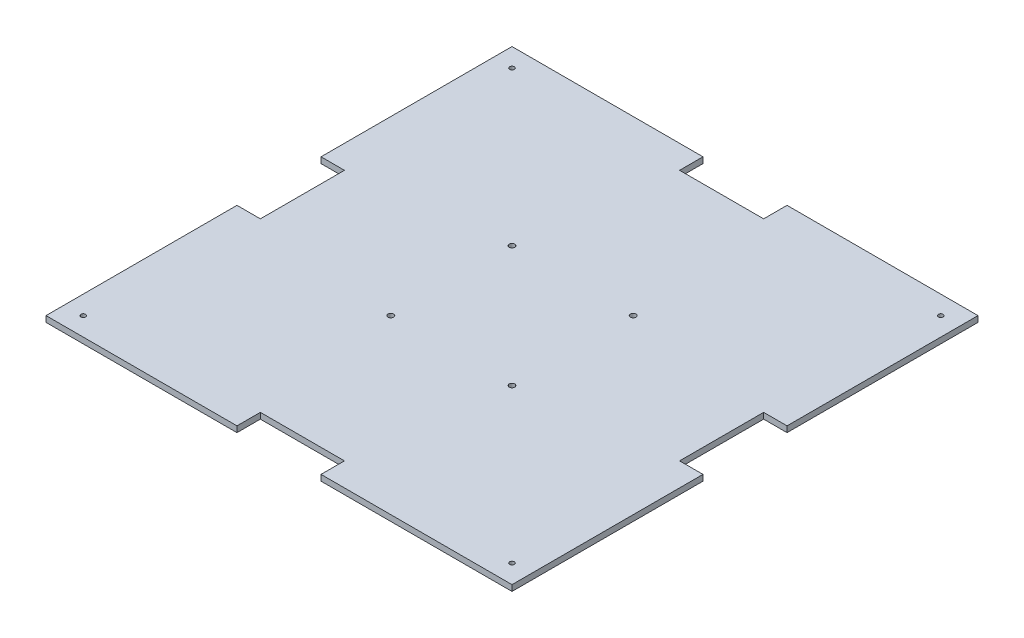
ISO-10303-21;
HEADER;
FILE_DESCRIPTION(('STEP AP214'),'2;1');
FILE_NAME('part.step','',(''),(''),'','','');
FILE_SCHEMA(('AUTOMOTIVE_DESIGN { 1 0 10303 214 1 1 1 1 }'));
ENDSEC;
DATA;
#1=APPLICATION_CONTEXT('core data for automotive mechanical design processes');
#2=APPLICATION_PROTOCOL_DEFINITION('international standard','automotive_design',2000,#1);
#3=PRODUCT_CONTEXT('',#1,'mechanical');
#4=PRODUCT('Part','Part','',(#3));
#5=PRODUCT_RELATED_PRODUCT_CATEGORY('part','',(#4));
#6=PRODUCT_DEFINITION_FORMATION('','',#4);
#7=PRODUCT_DEFINITION_CONTEXT('part definition',#1,'design');
#8=PRODUCT_DEFINITION('design','',#6,#7);
#9=PRODUCT_DEFINITION_SHAPE('','',#8);
#10=(LENGTH_UNIT() NAMED_UNIT(*) SI_UNIT(.MILLI.,.METRE.));
#11=(NAMED_UNIT(*) PLANE_ANGLE_UNIT() SI_UNIT($,.RADIAN.));
#12=(NAMED_UNIT(*) SI_UNIT($,.STERADIAN.) SOLID_ANGLE_UNIT());
#13=UNCERTAINTY_MEASURE_WITH_UNIT(LENGTH_MEASURE(1.E-05),#10,'distance_accuracy_value','');
#14=(GEOMETRIC_REPRESENTATION_CONTEXT(3) GLOBAL_UNCERTAINTY_ASSIGNED_CONTEXT((#13)) GLOBAL_UNIT_ASSIGNED_CONTEXT((#10,
#11,#12)) REPRESENTATION_CONTEXT('',''));
#15=CARTESIAN_POINT('',(0.,0.,0.));
#16=DIRECTION('',(0.,0.,1.));
#17=DIRECTION('',(1.,0.,0.));
#18=AXIS2_PLACEMENT_3D('',#15,#16,#17);
#19=CARTESIAN_POINT('',(234.900589833558,131.687026836977,334.189670911384));
#20=DIRECTION('',(-1.,0.,0.));
#21=DIRECTION('',(0.,0.,1.));
#22=AXIS2_PLACEMENT_3D('',#19,#20,#21);
#23=PLANE('',#22);
#24=DIRECTION('',(0.,0.,-1.));
#25=VECTOR('',#24,1.);
#26=CARTESIAN_POINT('',(234.900589833558,131.687026836977,334.189670911384));
#27=LINE('',#26,#25);
#28=CARTESIAN_POINT('',(234.900589833558,131.687026836977,186.639670911382));
#29=VERTEX_POINT('',#28);
#30=CARTESIAN_POINT('',(234.900589833558,131.687026836977,84.1896709113836));
#31=VERTEX_POINT('',#30);
#32=EDGE_CURVE('E237',#29,#31,#27,.T.);
#33=ORIENTED_EDGE('',*,*,#32,.F.);
#34=DIRECTION('',(0.,-1.,0.));
#35=VECTOR('',#34,1.);
#36=CARTESIAN_POINT('',(234.900589833558,131.687026836977,186.639670911382));
#37=LINE('',#36,#35);
#38=CARTESIAN_POINT('',(234.900589833558,128.512026836977,186.639670911382));
#39=VERTEX_POINT('',#38);
#40=EDGE_CURVE('E225',#29,#39,#37,.T.);
#41=ORIENTED_EDGE('',*,*,#40,.T.);
#42=DIRECTION('',(0.,0.,-1.));
#43=VECTOR('',#42,1.);
#44=CARTESIAN_POINT('',(234.900589833558,128.512026836977,334.189670911384));
#45=LINE('',#44,#43);
#46=CARTESIAN_POINT('',(234.900589833558,128.512026836977,84.1896709113836));
#47=VERTEX_POINT('',#46);
#48=EDGE_CURVE('E232',#39,#47,#45,.T.);
#49=ORIENTED_EDGE('',*,*,#48,.T.);
#50=DIRECTION('',(0.,-1.,0.));
#51=VECTOR('',#50,1.);
#52=CARTESIAN_POINT('',(234.900589833558,131.687026836977,84.1896709113836));
#53=LINE('',#52,#51);
#54=EDGE_CURVE('E272',#31,#47,#53,.T.);
#55=ORIENTED_EDGE('',*,*,#54,.F.);
#56=EDGE_LOOP('',(#33,#41,#49,#55));
#57=FACE_BOUND('',#56,.T.);
#58=ADVANCED_FACE('F16',(#57),#23,.F.);
#59=CARTESIAN_POINT('',(-15.0994101664421,131.687026836977,84.1896709113836));
#60=DIRECTION('',(0.,0.,1.));
#61=DIRECTION('',(1.,0.,0.));
#62=AXIS2_PLACEMENT_3D('',#59,#60,#61);
#63=PLANE('',#62);
#64=DIRECTION('',(-1.,0.,0.));
#65=VECTOR('',#64,1.);
#66=CARTESIAN_POINT('',(-15.0994101664421,128.512026836977,84.1896709113836));
#67=LINE('',#66,#65);
#68=CARTESIAN_POINT('',(132.450589833558,128.512026836977,84.1896709113836));
#69=VERTEX_POINT('',#68);
#70=EDGE_CURVE('E253',#47,#69,#67,.T.);
#71=ORIENTED_EDGE('',*,*,#70,.T.);
#72=DIRECTION('',(0.,1.,0.));
#73=VECTOR('',#72,1.);
#74=CARTESIAN_POINT('',(132.450589833558,131.687026836977,84.1896709113836));
#75=LINE('',#74,#73);
#76=CARTESIAN_POINT('',(132.450589833558,131.687026836977,84.1896709113836));
#77=VERTEX_POINT('',#76);
#78=EDGE_CURVE('E229',#69,#77,#75,.T.);
#79=ORIENTED_EDGE('',*,*,#78,.T.);
#80=DIRECTION('',(-1.,0.,0.));
#81=VECTOR('',#80,1.);
#82=CARTESIAN_POINT('',(-15.0994101664421,131.687026836977,84.1896709113836));
#83=LINE('',#82,#81);
#84=EDGE_CURVE('E238',#31,#77,#83,.T.);
#85=ORIENTED_EDGE('',*,*,#84,.F.);
#86=ORIENTED_EDGE('',*,*,#54,.T.);
#87=EDGE_LOOP('',(#71,#79,#85,#86));
#88=FACE_BOUND('',#87,.T.);
#89=ADVANCED_FACE('F369',(#88),#63,.F.);
#90=CARTESIAN_POINT('',(-15.0994101664421,131.687026836977,334.189670911384));
#91=DIRECTION('',(1.,0.,0.));
#92=DIRECTION('',(0.,0.,-1.));
#93=AXIS2_PLACEMENT_3D('',#90,#91,#92);
#94=PLANE('',#93);
#95=DIRECTION('',(0.,0.,1.));
#96=VECTOR('',#95,1.);
#97=CARTESIAN_POINT('',(-15.0994101664421,131.687026836977,334.189670911384));
#98=LINE('',#97,#96);
#99=CARTESIAN_POINT('',(-15.0994101664421,131.687026836977,231.739670911385));
#100=VERTEX_POINT('',#99);
#101=CARTESIAN_POINT('',(-15.0994101664421,131.687026836977,334.189670911384));
#102=VERTEX_POINT('',#101);
#103=EDGE_CURVE('E240',#100,#102,#98,.T.);
#104=ORIENTED_EDGE('',*,*,#103,.F.);
#105=DIRECTION('',(0.,-1.,0.));
#106=VECTOR('',#105,1.);
#107=CARTESIAN_POINT('',(-15.0994101664421,131.687026836977,231.739670911385));
#108=LINE('',#107,#106);
#109=CARTESIAN_POINT('',(-15.0994101664421,128.512026836977,231.739670911385));
#110=VERTEX_POINT('',#109);
#111=EDGE_CURVE('E213',#100,#110,#108,.T.);
#112=ORIENTED_EDGE('',*,*,#111,.T.);
#113=DIRECTION('',(0.,0.,1.));
#114=VECTOR('',#113,1.);
#115=CARTESIAN_POINT('',(-15.0994101664421,128.512026836977,334.189670911384));
#116=LINE('',#115,#114);
#117=CARTESIAN_POINT('',(-15.0994101664421,128.512026836977,334.189670911384));
#118=VERTEX_POINT('',#117);
#119=EDGE_CURVE('E256',#110,#118,#116,.T.);
#120=ORIENTED_EDGE('',*,*,#119,.T.);
#121=DIRECTION('',(0.,-1.,0.));
#122=VECTOR('',#121,1.);
#123=CARTESIAN_POINT('',(-15.0994101664421,131.687026836977,334.189670911384));
#124=LINE('',#123,#122);
#125=EDGE_CURVE('E266',#102,#118,#124,.T.);
#126=ORIENTED_EDGE('',*,*,#125,.F.);
#127=EDGE_LOOP('',(#104,#112,#120,#126));
#128=FACE_BOUND('',#127,.T.);
#129=ADVANCED_FACE('F320',(#128),#94,.F.);
#130=CARTESIAN_POINT('',(-15.0994101664421,131.687026836977,334.189670911384));
#131=DIRECTION('',(0.,0.,-1.));
#132=DIRECTION('',(-1.,0.,0.));
#133=AXIS2_PLACEMENT_3D('',#130,#131,#132);
#134=PLANE('',#133);
#135=DIRECTION('',(1.,0.,0.));
#136=VECTOR('',#135,1.);
#137=CARTESIAN_POINT('',(-15.0994101664421,131.687026836977,334.189670911384));
#138=LINE('',#137,#136);
#139=CARTESIAN_POINT('',(132.450589833561,131.687026836977,334.189670911384));
#140=VERTEX_POINT('',#139);
#141=CARTESIAN_POINT('',(234.900589833558,131.687026836977,334.189670911384));
#142=VERTEX_POINT('',#141);
#143=EDGE_CURVE('E244',#140,#142,#138,.T.);
#144=ORIENTED_EDGE('',*,*,#143,.F.);
#145=DIRECTION('',(0.,-1.,0.));
#146=VECTOR('',#145,1.);
#147=CARTESIAN_POINT('',(132.450589833561,131.687026836977,334.189670911384));
#148=LINE('',#147,#146);
#149=CARTESIAN_POINT('',(132.450589833561,128.512026836977,334.189670911384));
#150=VERTEX_POINT('',#149);
#151=EDGE_CURVE('E219',#140,#150,#148,.T.);
#152=ORIENTED_EDGE('',*,*,#151,.T.);
#153=DIRECTION('',(1.,0.,0.));
#154=VECTOR('',#153,1.);
#155=CARTESIAN_POINT('',(-15.0994101664421,128.512026836977,334.189670911384));
#156=LINE('',#155,#154);
#157=CARTESIAN_POINT('',(234.900589833558,128.512026836977,334.189670911384));
#158=VERTEX_POINT('',#157);
#159=EDGE_CURVE('E260',#150,#158,#156,.T.);
#160=ORIENTED_EDGE('',*,*,#159,.T.);
#161=DIRECTION('',(0.,-1.,0.));
#162=VECTOR('',#161,1.);
#163=CARTESIAN_POINT('',(234.900589833558,131.687026836977,334.189670911384));
#164=LINE('',#163,#162);
#165=EDGE_CURVE('E248',#142,#158,#164,.T.);
#166=ORIENTED_EDGE('',*,*,#165,.F.);
#167=EDGE_LOOP('',(#144,#152,#160,#166));
#168=FACE_BOUND('',#167,.T.);
#169=ADVANCED_FACE('F343',(#168),#134,.F.);
#170=CARTESIAN_POINT('',(234.900589833558,128.512026836977,231.739670911382));
#171=VERTEX_POINT('',#170);
#172=EDGE_CURVE('E249',#158,#171,#45,.T.);
#173=ORIENTED_EDGE('',*,*,#172,.T.);
#174=DIRECTION('',(0.,1.,0.));
#175=VECTOR('',#174,1.);
#176=CARTESIAN_POINT('',(234.900589833558,131.687026836977,231.739670911382));
#177=LINE('',#176,#175);
#178=CARTESIAN_POINT('',(234.900589833558,131.687026836977,231.739670911382));
#179=VERTEX_POINT('',#178);
#180=EDGE_CURVE('E222',#171,#179,#177,.T.);
#181=ORIENTED_EDGE('',*,*,#180,.T.);
#182=EDGE_CURVE('E233',#142,#179,#27,.T.);
#183=ORIENTED_EDGE('',*,*,#182,.F.);
#184=ORIENTED_EDGE('',*,*,#165,.T.);
#185=EDGE_LOOP('',(#173,#181,#183,#184));
#186=FACE_BOUND('',#185,.T.);
#187=ADVANCED_FACE('F18',(#186),#23,.F.);
#188=CARTESIAN_POINT('',(87.3505898335579,131.687026836977,84.1896709113836));
#189=VERTEX_POINT('',#188);
#190=CARTESIAN_POINT('',(-15.0994101664421,131.687026836977,84.1896709113836));
#191=VERTEX_POINT('',#190);
#192=EDGE_CURVE('E236',#189,#191,#83,.T.);
#193=ORIENTED_EDGE('',*,*,#192,.F.);
#194=DIRECTION('',(0.,-1.,0.));
#195=VECTOR('',#194,1.);
#196=CARTESIAN_POINT('',(87.3505898335579,131.687026836977,84.1896709113836));
#197=LINE('',#196,#195);
#198=CARTESIAN_POINT('',(87.3505898335579,128.512026836977,84.1896709113836));
#199=VERTEX_POINT('',#198);
#200=EDGE_CURVE('E164',#189,#199,#197,.T.);
#201=ORIENTED_EDGE('',*,*,#200,.T.);
#202=CARTESIAN_POINT('',(-15.0994101664421,128.512026836977,84.1896709113836));
#203=VERTEX_POINT('',#202);
#204=EDGE_CURVE('E252',#199,#203,#67,.T.);
#205=ORIENTED_EDGE('',*,*,#204,.T.);
#206=DIRECTION('',(0.,-1.,0.));
#207=VECTOR('',#206,1.);
#208=CARTESIAN_POINT('',(-15.0994101664421,131.687026836977,84.1896709113836));
#209=LINE('',#208,#207);
#210=EDGE_CURVE('E269',#191,#203,#209,.T.);
#211=ORIENTED_EDGE('',*,*,#210,.F.);
#212=EDGE_LOOP('',(#193,#201,#205,#211));
#213=FACE_BOUND('',#212,.T.);
#214=ADVANCED_FACE('F297',(#213),#63,.F.);
#215=CARTESIAN_POINT('',(-15.0994101664421,128.512026836977,186.639670911385));
#216=VERTEX_POINT('',#215);
#217=EDGE_CURVE('E257',#203,#216,#116,.T.);
#218=ORIENTED_EDGE('',*,*,#217,.T.);
#219=DIRECTION('',(0.,1.,0.));
#220=VECTOR('',#219,1.);
#221=CARTESIAN_POINT('',(-15.0994101664421,131.687026836977,186.639670911385));
#222=LINE('',#221,#220);
#223=CARTESIAN_POINT('',(-15.0994101664421,131.687026836977,186.639670911385));
#224=VERTEX_POINT('',#223);
#225=EDGE_CURVE('E39',#216,#224,#222,.T.);
#226=ORIENTED_EDGE('',*,*,#225,.T.);
#227=EDGE_CURVE('E241',#191,#224,#98,.T.);
#228=ORIENTED_EDGE('',*,*,#227,.F.);
#229=ORIENTED_EDGE('',*,*,#210,.T.);
#230=EDGE_LOOP('',(#218,#226,#228,#229));
#231=FACE_BOUND('',#230,.T.);
#232=ADVANCED_FACE('F304',(#231),#94,.F.);
#233=CARTESIAN_POINT('',(87.350589833561,128.512026836977,334.189670911384));
#234=VERTEX_POINT('',#233);
#235=EDGE_CURVE('E261',#118,#234,#156,.T.);
#236=ORIENTED_EDGE('',*,*,#235,.T.);
#237=DIRECTION('',(0.,1.,0.));
#238=VECTOR('',#237,1.);
#239=CARTESIAN_POINT('',(87.350589833561,131.687026836977,334.189670911384));
#240=LINE('',#239,#238);
#241=CARTESIAN_POINT('',(87.350589833561,131.687026836977,334.189670911384));
#242=VERTEX_POINT('',#241);
#243=EDGE_CURVE('E216',#234,#242,#240,.T.);
#244=ORIENTED_EDGE('',*,*,#243,.T.);
#245=EDGE_CURVE('E245',#102,#242,#138,.T.);
#246=ORIENTED_EDGE('',*,*,#245,.F.);
#247=ORIENTED_EDGE('',*,*,#125,.T.);
#248=EDGE_LOOP('',(#236,#244,#246,#247));
#249=FACE_BOUND('',#248,.T.);
#250=ADVANCED_FACE('F325',(#249),#134,.F.);
#251=CARTESIAN_POINT('',(109.900589833558,131.687026836977,209.189670911384));
#252=DIRECTION('',(0.,-1.,0.));
#253=DIRECTION('',(0.,0.,-1.));
#254=AXIS2_PLACEMENT_3D('',#251,#252,#253);
#255=PLANE('',#254);
#256=CARTESIAN_POINT('',(142.400589326919,131.687026836977,241.689672416403));
#257=DIRECTION('',(0.,1.,0.));
#258=DIRECTION('',(0.,0.,1.));
#259=AXIS2_PLACEMENT_3D('',#256,#257,#258);
#260=CIRCLE('',#259,1.5);
#261=CARTESIAN_POINT('',(142.400589326919,131.687026836977,243.189672416403));
#262=VERTEX_POINT('',#261);
#263=EDGE_CURVE('E415',#262,#262,#260,.T.);
#264=ORIENTED_EDGE('',*,*,#263,.F.);
#265=EDGE_LOOP('',(#264));
#266=FACE_BOUND('',#265,.T.);
#267=CARTESIAN_POINT('',(77.400591562093,131.687026836977,241.689671909763));
#268=DIRECTION('',(0.,1.,0.));
#269=DIRECTION('',(0.,0.,1.));
#270=AXIS2_PLACEMENT_3D('',#267,#268,#269);
#271=CIRCLE('',#270,1.5);
#272=CARTESIAN_POINT('',(77.400591562093,131.687026836977,243.189671909763));
#273=VERTEX_POINT('',#272);
#274=EDGE_CURVE('E409',#273,#273,#271,.T.);
#275=ORIENTED_EDGE('',*,*,#274,.F.);
#276=EDGE_LOOP('',(#275));
#277=FACE_BOUND('',#276,.T.);
#278=CARTESIAN_POINT('',(142.400589833558,131.687026836977,176.689674651577));
#279=DIRECTION('',(0.,1.,0.));
#280=DIRECTION('',(0.,0.,1.));
#281=AXIS2_PLACEMENT_3D('',#278,#279,#280);
#282=CIRCLE('',#281,1.5);
#283=CARTESIAN_POINT('',(142.400589833558,131.687026836977,178.189674651577));
#284=VERTEX_POINT('',#283);
#285=EDGE_CURVE('E403',#284,#284,#282,.T.);
#286=ORIENTED_EDGE('',*,*,#285,.F.);
#287=EDGE_LOOP('',(#286));
#288=FACE_BOUND('',#287,.T.);
#289=CARTESIAN_POINT('',(77.4005920687322,131.687026836977,176.689674144938));
#290=DIRECTION('',(0.,1.,0.));
#291=DIRECTION('',(0.,0.,1.));
#292=AXIS2_PLACEMENT_3D('',#289,#290,#291);
#293=CIRCLE('',#292,1.5);
#294=CARTESIAN_POINT('',(77.4005920687322,131.687026836977,178.189674144938));
#295=VERTEX_POINT('',#294);
#296=EDGE_CURVE('E397',#295,#295,#293,.T.);
#297=ORIENTED_EDGE('',*,*,#296,.F.);
#298=EDGE_LOOP('',(#297));
#299=FACE_BOUND('',#298,.T.);
#300=CARTESIAN_POINT('',(224.900589833558,131.687026836977,94.1896709113836));
#301=DIRECTION('',(0.,1.,0.));
#302=DIRECTION('',(0.,0.,1.));
#303=AXIS2_PLACEMENT_3D('',#300,#301,#302);
#304=CIRCLE('',#303,1.24999999999999);
#305=CARTESIAN_POINT('',(224.900589833558,131.687026836977,95.4396709113835));
#306=VERTEX_POINT('',#305);
#307=EDGE_CURVE('E393',#306,#306,#304,.T.);
#308=ORIENTED_EDGE('',*,*,#307,.F.);
#309=EDGE_LOOP('',(#308));
#310=FACE_BOUND('',#309,.T.);
#311=CARTESIAN_POINT('',(224.900589833558,131.687026836977,324.189670911384));
#312=DIRECTION('',(0.,1.,0.));
#313=DIRECTION('',(0.,0.,1.));
#314=AXIS2_PLACEMENT_3D('',#311,#312,#313);
#315=CIRCLE('',#314,1.24999999999999);
#316=CARTESIAN_POINT('',(224.900589833558,131.687026836977,325.439670911384));
#317=VERTEX_POINT('',#316);
#318=EDGE_CURVE('E387',#317,#317,#315,.T.);
#319=ORIENTED_EDGE('',*,*,#318,.F.);
#320=EDGE_LOOP('',(#319));
#321=FACE_BOUND('',#320,.T.);
#322=CARTESIAN_POINT('',(-5.09941016644209,131.687026836977,324.189670911384));
#323=DIRECTION('',(0.,1.,0.));
#324=DIRECTION('',(0.,0.,1.));
#325=AXIS2_PLACEMENT_3D('',#322,#323,#324);
#326=CIRCLE('',#325,1.24999999999999);
#327=CARTESIAN_POINT('',(-5.09941016644209,131.687026836977,325.439670911384));
#328=VERTEX_POINT('',#327);
#329=EDGE_CURVE('E381',#328,#328,#326,.T.);
#330=ORIENTED_EDGE('',*,*,#329,.F.);
#331=EDGE_LOOP('',(#330));
#332=FACE_BOUND('',#331,.T.);
#333=CARTESIAN_POINT('',(-5.09941016644209,131.687026836977,94.1896709113836));
#334=DIRECTION('',(0.,1.,0.));
#335=DIRECTION('',(0.,0.,1.));
#336=AXIS2_PLACEMENT_3D('',#333,#334,#335);
#337=CIRCLE('',#336,1.24999999999999);
#338=CARTESIAN_POINT('',(-5.09941016644209,131.687026836977,95.4396709113836));
#339=VERTEX_POINT('',#338);
#340=EDGE_CURVE('E375',#339,#339,#337,.T.);
#341=ORIENTED_EDGE('',*,*,#340,.F.);
#342=EDGE_LOOP('',(#341));
#343=FACE_BOUND('',#342,.T.);
#344=ORIENTED_EDGE('',*,*,#84,.T.);
#345=DIRECTION('',(0.,0.,-1.));
#346=VECTOR('',#345,1.);
#347=CARTESIAN_POINT('',(132.450589833558,131.687026836977,71.6396709113836));
#348=LINE('',#347,#346);
#349=CARTESIAN_POINT('',(132.450589833558,131.687026836977,96.7396709113836));
#350=VERTEX_POINT('',#349);
#351=EDGE_CURVE('E167',#350,#77,#348,.T.);
#352=ORIENTED_EDGE('',*,*,#351,.F.);
#353=DIRECTION('',(1.,0.,0.));
#354=VECTOR('',#353,1.);
#355=CARTESIAN_POINT('',(87.3505898335579,131.687026836977,96.7396709113836));
#356=LINE('',#355,#354);
#357=CARTESIAN_POINT('',(87.3505898335579,131.687026836977,96.7396709113836));
#358=VERTEX_POINT('',#357);
#359=EDGE_CURVE('E154',#358,#350,#356,.T.);
#360=ORIENTED_EDGE('',*,*,#359,.F.);
#361=DIRECTION('',(0.,0.,1.));
#362=VECTOR('',#361,1.);
#363=CARTESIAN_POINT('',(87.3505898335579,131.687026836977,71.6396709113836));
#364=LINE('',#363,#362);
#365=EDGE_CURVE('E161',#189,#358,#364,.T.);
#366=ORIENTED_EDGE('',*,*,#365,.F.);
#367=ORIENTED_EDGE('',*,*,#192,.T.);
#368=ORIENTED_EDGE('',*,*,#227,.T.);
#369=DIRECTION('',(-1.,0.,0.));
#370=VECTOR('',#369,1.);
#371=CARTESIAN_POINT('',(-27.6494101664402,131.687026836977,186.639670911385));
#372=LINE('',#371,#370);
#373=CARTESIAN_POINT('',(-2.5494101664402,131.687026836977,186.639670911385));
#374=VERTEX_POINT('',#373);
#375=EDGE_CURVE('E203',#374,#224,#372,.T.);
#376=ORIENTED_EDGE('',*,*,#375,.F.);
#377=DIRECTION('',(0.,0.,-1.));
#378=VECTOR('',#377,1.);
#379=CARTESIAN_POINT('',(-2.5494101664402,131.687026836977,231.739670911385));
#380=LINE('',#379,#378);
#381=CARTESIAN_POINT('',(-2.5494101664402,131.687026836977,231.739670911385));
#382=VERTEX_POINT('',#381);
#383=EDGE_CURVE('E200',#382,#374,#380,.T.);
#384=ORIENTED_EDGE('',*,*,#383,.F.);
#385=DIRECTION('',(1.,0.,0.));
#386=VECTOR('',#385,1.);
#387=CARTESIAN_POINT('',(-27.6494101664402,131.687026836977,231.739670911385));
#388=LINE('',#387,#386);
#389=EDGE_CURVE('E206',#100,#382,#388,.T.);
#390=ORIENTED_EDGE('',*,*,#389,.F.);
#391=ORIENTED_EDGE('',*,*,#103,.T.);
#392=ORIENTED_EDGE('',*,*,#245,.T.);
#393=DIRECTION('',(0.,0.,1.));
#394=VECTOR('',#393,1.);
#395=CARTESIAN_POINT('',(87.350589833561,131.687026836977,346.739670911383));
#396=LINE('',#395,#394);
#397=CARTESIAN_POINT('',(87.350589833561,131.687026836977,321.639670911383));
#398=VERTEX_POINT('',#397);
#399=EDGE_CURVE('E191',#398,#242,#396,.T.);
#400=ORIENTED_EDGE('',*,*,#399,.F.);
#401=DIRECTION('',(-1.,0.,0.));
#402=VECTOR('',#401,1.);
#403=CARTESIAN_POINT('',(132.450589833561,131.687026836977,321.639670911383));
#404=LINE('',#403,#402);
#405=CARTESIAN_POINT('',(132.450589833561,131.687026836977,321.639670911383));
#406=VERTEX_POINT('',#405);
#407=EDGE_CURVE('E188',#406,#398,#404,.T.);
#408=ORIENTED_EDGE('',*,*,#407,.F.);
#409=DIRECTION('',(0.,0.,-1.));
#410=VECTOR('',#409,1.);
#411=CARTESIAN_POINT('',(132.450589833561,131.687026836977,346.739670911383));
#412=LINE('',#411,#410);
#413=EDGE_CURVE('E194',#140,#406,#412,.T.);
#414=ORIENTED_EDGE('',*,*,#413,.F.);
#415=ORIENTED_EDGE('',*,*,#143,.T.);
#416=ORIENTED_EDGE('',*,*,#182,.T.);
#417=DIRECTION('',(1.,0.,0.));
#418=VECTOR('',#417,1.);
#419=CARTESIAN_POINT('',(247.450589833559,131.687026836977,231.739670911382));
#420=LINE('',#419,#418);
#421=CARTESIAN_POINT('',(222.350589833559,131.687026836977,231.739670911382));
#422=VERTEX_POINT('',#421);
#423=EDGE_CURVE('E178',#422,#179,#420,.T.);
#424=ORIENTED_EDGE('',*,*,#423,.F.);
#425=DIRECTION('',(0.,0.,1.));
#426=VECTOR('',#425,1.);
#427=CARTESIAN_POINT('',(222.350589833559,131.687026836977,186.639670911382));
#428=LINE('',#427,#426);
#429=CARTESIAN_POINT('',(222.350589833559,131.687026836977,186.639670911382));
#430=VERTEX_POINT('',#429);
#431=EDGE_CURVE('E175',#430,#422,#428,.T.);
#432=ORIENTED_EDGE('',*,*,#431,.F.);
#433=DIRECTION('',(-1.,0.,0.));
#434=VECTOR('',#433,1.);
#435=CARTESIAN_POINT('',(247.450589833559,131.687026836977,186.639670911382));
#436=LINE('',#435,#434);
#437=EDGE_CURVE('E181',#29,#430,#436,.T.);
#438=ORIENTED_EDGE('',*,*,#437,.F.);
#439=ORIENTED_EDGE('',*,*,#32,.T.);
#440=EDGE_LOOP('',(#344,#352,#360,#366,#367,#368,#376,#384,#390,#391,#392,#400,#408,#414,#415,
#416,#424,#432,#438,#439));
#441=FACE_BOUND('',#440,.T.);
#442=ADVANCED_FACE('F170',(#266,#277,#288,#299,#310,#321,#332,#343,#441),#255,.F.);
#443=CARTESIAN_POINT('',(109.900589833558,128.512026836977,209.189670911384));
#444=DIRECTION('',(0.,-1.,0.));
#445=DIRECTION('',(0.,0.,-1.));
#446=AXIS2_PLACEMENT_3D('',#443,#444,#445);
#447=PLANE('',#446);
#448=CARTESIAN_POINT('',(142.400589326919,128.512026836977,241.689672416403));
#449=DIRECTION('',(0.,1.,0.));
#450=DIRECTION('',(0.,0.,1.));
#451=AXIS2_PLACEMENT_3D('',#448,#449,#450);
#452=CIRCLE('',#451,1.5);
#453=CARTESIAN_POINT('',(142.400589326919,128.512026836977,243.189672416403));
#454=VERTEX_POINT('',#453);
#455=EDGE_CURVE('E412',#454,#454,#452,.T.);
#456=ORIENTED_EDGE('',*,*,#455,.T.);
#457=EDGE_LOOP('',(#456));
#458=FACE_BOUND('',#457,.T.);
#459=CARTESIAN_POINT('',(77.400591562093,128.512026836977,241.689671909763));
#460=DIRECTION('',(0.,1.,0.));
#461=DIRECTION('',(0.,0.,1.));
#462=AXIS2_PLACEMENT_3D('',#459,#460,#461);
#463=CIRCLE('',#462,1.5);
#464=CARTESIAN_POINT('',(77.400591562093,128.512026836977,243.189671909763));
#465=VERTEX_POINT('',#464);
#466=EDGE_CURVE('E406',#465,#465,#463,.T.);
#467=ORIENTED_EDGE('',*,*,#466,.T.);
#468=EDGE_LOOP('',(#467));
#469=FACE_BOUND('',#468,.T.);
#470=CARTESIAN_POINT('',(142.400589833558,128.512026836977,176.689674651577));
#471=DIRECTION('',(0.,1.,0.));
#472=DIRECTION('',(0.,0.,1.));
#473=AXIS2_PLACEMENT_3D('',#470,#471,#472);
#474=CIRCLE('',#473,1.5);
#475=CARTESIAN_POINT('',(142.400589833558,128.512026836977,178.189674651577));
#476=VERTEX_POINT('',#475);
#477=EDGE_CURVE('E400',#476,#476,#474,.T.);
#478=ORIENTED_EDGE('',*,*,#477,.T.);
#479=EDGE_LOOP('',(#478));
#480=FACE_BOUND('',#479,.T.);
#481=CARTESIAN_POINT('',(77.4005920687322,128.512026836977,176.689674144938));
#482=DIRECTION('',(0.,1.,0.));
#483=DIRECTION('',(0.,0.,1.));
#484=AXIS2_PLACEMENT_3D('',#481,#482,#483);
#485=CIRCLE('',#484,1.5);
#486=CARTESIAN_POINT('',(77.4005920687322,128.512026836977,178.189674144938));
#487=VERTEX_POINT('',#486);
#488=EDGE_CURVE('E396',#487,#487,#485,.T.);
#489=ORIENTED_EDGE('',*,*,#488,.T.);
#490=EDGE_LOOP('',(#489));
#491=FACE_BOUND('',#490,.T.);
#492=CARTESIAN_POINT('',(224.900589833558,128.512026836977,94.1896709113836));
#493=DIRECTION('',(0.,1.,0.));
#494=DIRECTION('',(0.,0.,1.));
#495=AXIS2_PLACEMENT_3D('',#492,#493,#494);
#496=CIRCLE('',#495,1.25);
#497=CARTESIAN_POINT('',(224.900589833558,128.512026836977,95.4396709113836));
#498=VERTEX_POINT('',#497);
#499=EDGE_CURVE('E390',#498,#498,#496,.T.);
#500=ORIENTED_EDGE('',*,*,#499,.T.);
#501=EDGE_LOOP('',(#500));
#502=FACE_BOUND('',#501,.T.);
#503=CARTESIAN_POINT('',(224.900589833558,128.512026836977,324.189670911384));
#504=DIRECTION('',(0.,1.,0.));
#505=DIRECTION('',(0.,0.,1.));
#506=AXIS2_PLACEMENT_3D('',#503,#504,#505);
#507=CIRCLE('',#506,1.25);
#508=CARTESIAN_POINT('',(224.900589833558,128.512026836977,325.439670911384));
#509=VERTEX_POINT('',#508);
#510=EDGE_CURVE('E384',#509,#509,#507,.T.);
#511=ORIENTED_EDGE('',*,*,#510,.T.);
#512=EDGE_LOOP('',(#511));
#513=FACE_BOUND('',#512,.T.);
#514=CARTESIAN_POINT('',(-5.09941016644209,128.512026836977,324.189670911384));
#515=DIRECTION('',(0.,1.,0.));
#516=DIRECTION('',(0.,0.,1.));
#517=AXIS2_PLACEMENT_3D('',#514,#515,#516);
#518=CIRCLE('',#517,1.25);
#519=CARTESIAN_POINT('',(-5.09941016644209,128.512026836977,325.439670911384));
#520=VERTEX_POINT('',#519);
#521=EDGE_CURVE('E378',#520,#520,#518,.T.);
#522=ORIENTED_EDGE('',*,*,#521,.T.);
#523=EDGE_LOOP('',(#522));
#524=FACE_BOUND('',#523,.T.);
#525=CARTESIAN_POINT('',(-5.09941016644209,128.512026836977,94.1896709113836));
#526=DIRECTION('',(0.,1.,0.));
#527=DIRECTION('',(0.,0.,1.));
#528=AXIS2_PLACEMENT_3D('',#525,#526,#527);
#529=CIRCLE('',#528,1.25);
#530=CARTESIAN_POINT('',(-5.09941016644209,128.512026836977,95.4396709113836));
#531=VERTEX_POINT('',#530);
#532=EDGE_CURVE('E204',#531,#531,#529,.T.);
#533=ORIENTED_EDGE('',*,*,#532,.T.);
#534=EDGE_LOOP('',(#533));
#535=FACE_BOUND('',#534,.T.);
#536=DIRECTION('',(0.,0.,1.));
#537=VECTOR('',#536,1.);
#538=CARTESIAN_POINT('',(132.450589833558,128.512026836977,209.189670911384));
#539=LINE('',#538,#537);
#540=CARTESIAN_POINT('',(132.450589833558,128.512026836977,96.7396709113836));
#541=VERTEX_POINT('',#540);
#542=EDGE_CURVE('E10',#69,#541,#539,.T.);
#543=ORIENTED_EDGE('',*,*,#542,.F.);
#544=ORIENTED_EDGE('',*,*,#70,.F.);
#545=ORIENTED_EDGE('',*,*,#48,.F.);
#546=DIRECTION('',(1.,0.,0.));
#547=VECTOR('',#546,1.);
#548=CARTESIAN_POINT('',(109.900589833558,128.512026836977,186.639670911382));
#549=LINE('',#548,#547);
#550=CARTESIAN_POINT('',(222.350589833559,128.512026836977,186.639670911382));
#551=VERTEX_POINT('',#550);
#552=EDGE_CURVE('E291',#551,#39,#549,.T.);
#553=ORIENTED_EDGE('',*,*,#552,.F.);
#554=DIRECTION('',(0.,0.,-1.));
#555=VECTOR('',#554,1.);
#556=CARTESIAN_POINT('',(222.350589833559,128.512026836977,209.189670911384));
#557=LINE('',#556,#555);
#558=CARTESIAN_POINT('',(222.350589833559,128.512026836977,231.739670911382));
#559=VERTEX_POINT('',#558);
#560=EDGE_CURVE('E289',#559,#551,#557,.T.);
#561=ORIENTED_EDGE('',*,*,#560,.F.);
#562=DIRECTION('',(-1.,0.,0.));
#563=VECTOR('',#562,1.);
#564=CARTESIAN_POINT('',(109.900589833558,128.512026836977,231.739670911382));
#565=LINE('',#564,#563);
#566=EDGE_CURVE('E287',#171,#559,#565,.T.);
#567=ORIENTED_EDGE('',*,*,#566,.F.);
#568=ORIENTED_EDGE('',*,*,#172,.F.);
#569=ORIENTED_EDGE('',*,*,#159,.F.);
#570=DIRECTION('',(0.,0.,1.));
#571=VECTOR('',#570,1.);
#572=CARTESIAN_POINT('',(132.450589833561,128.512026836977,209.189670911384));
#573=LINE('',#572,#571);
#574=CARTESIAN_POINT('',(132.450589833561,128.512026836977,321.639670911383));
#575=VERTEX_POINT('',#574);
#576=EDGE_CURVE('E285',#575,#150,#573,.T.);
#577=ORIENTED_EDGE('',*,*,#576,.F.);
#578=DIRECTION('',(1.,0.,0.));
#579=VECTOR('',#578,1.);
#580=CARTESIAN_POINT('',(109.900589833558,128.512026836977,321.639670911383));
#581=LINE('',#580,#579);
#582=CARTESIAN_POINT('',(87.350589833561,128.512026836977,321.639670911383));
#583=VERTEX_POINT('',#582);
#584=EDGE_CURVE('E283',#583,#575,#581,.T.);
#585=ORIENTED_EDGE('',*,*,#584,.F.);
#586=DIRECTION('',(0.,0.,-1.));
#587=VECTOR('',#586,1.);
#588=CARTESIAN_POINT('',(87.350589833561,128.512026836977,209.189670911384));
#589=LINE('',#588,#587);
#590=EDGE_CURVE('E281',#234,#583,#589,.T.);
#591=ORIENTED_EDGE('',*,*,#590,.F.);
#592=ORIENTED_EDGE('',*,*,#235,.F.);
#593=ORIENTED_EDGE('',*,*,#119,.F.);
#594=DIRECTION('',(-1.,0.,0.));
#595=VECTOR('',#594,1.);
#596=CARTESIAN_POINT('',(109.900589833558,128.512026836977,231.739670911385));
#597=LINE('',#596,#595);
#598=CARTESIAN_POINT('',(-2.5494101664402,128.512026836977,231.739670911385));
#599=VERTEX_POINT('',#598);
#600=EDGE_CURVE('E279',#599,#110,#597,.T.);
#601=ORIENTED_EDGE('',*,*,#600,.F.);
#602=DIRECTION('',(0.,0.,1.));
#603=VECTOR('',#602,1.);
#604=CARTESIAN_POINT('',(-2.5494101664402,128.512026836977,209.189670911384));
#605=LINE('',#604,#603);
#606=CARTESIAN_POINT('',(-2.5494101664402,128.512026836977,186.639670911385));
#607=VERTEX_POINT('',#606);
#608=EDGE_CURVE('E277',#607,#599,#605,.T.);
#609=ORIENTED_EDGE('',*,*,#608,.F.);
#610=DIRECTION('',(1.,0.,0.));
#611=VECTOR('',#610,1.);
#612=CARTESIAN_POINT('',(109.900589833558,128.512026836977,186.639670911385));
#613=LINE('',#612,#611);
#614=EDGE_CURVE('E275',#216,#607,#613,.T.);
#615=ORIENTED_EDGE('',*,*,#614,.F.);
#616=ORIENTED_EDGE('',*,*,#217,.F.);
#617=ORIENTED_EDGE('',*,*,#204,.F.);
#618=DIRECTION('',(0.,0.,-1.));
#619=VECTOR('',#618,1.);
#620=CARTESIAN_POINT('',(87.350589833558,128.512026836977,209.189670911384));
#621=LINE('',#620,#619);
#622=CARTESIAN_POINT('',(87.3505898335579,128.512026836977,96.7396709113836));
#623=VERTEX_POINT('',#622);
#624=EDGE_CURVE('E293',#623,#199,#621,.T.);
#625=ORIENTED_EDGE('',*,*,#624,.F.);
#626=DIRECTION('',(-1.,0.,0.));
#627=VECTOR('',#626,1.);
#628=CARTESIAN_POINT('',(109.900589833558,128.512026836977,96.7396709113836));
#629=LINE('',#628,#627);
#630=EDGE_CURVE('E24',#541,#623,#629,.T.);
#631=ORIENTED_EDGE('',*,*,#630,.F.);
#632=EDGE_LOOP('',(#543,#544,#545,#553,#561,#567,#568,#569,#577,#585,#591,#592,#593,#601,#609,
#615,#616,#617,#625,#631));
#633=FACE_BOUND('',#632,.T.);
#634=ADVANCED_FACE('F301',(#458,#469,#480,#491,#502,#513,#524,#535,#633),#447,.T.);
#635=CARTESIAN_POINT('',(-27.6494101664402,121.687026836977,231.739670911385));
#636=DIRECTION('',(0.,0.,1.));
#637=DIRECTION('',(1.,0.,0.));
#638=AXIS2_PLACEMENT_3D('',#635,#636,#637);
#639=PLANE('',#638);
#640=ORIENTED_EDGE('',*,*,#389,.T.);
#641=DIRECTION('',(0.,1.,0.));
#642=VECTOR('',#641,1.);
#643=CARTESIAN_POINT('',(-2.5494101664402,121.687026836977,231.739670911385));
#644=LINE('',#643,#642);
#645=EDGE_CURVE('E192',#599,#382,#644,.T.);
#646=ORIENTED_EDGE('',*,*,#645,.F.);
#647=ORIENTED_EDGE('',*,*,#600,.T.);
#648=ORIENTED_EDGE('',*,*,#111,.F.);
#649=EDGE_LOOP('',(#640,#646,#647,#648));
#650=FACE_BOUND('',#649,.T.);
#651=ADVANCED_FACE('F316',(#650),#639,.F.);
#652=CARTESIAN_POINT('',(-27.6494101664402,121.687026836977,186.639670911385));
#653=DIRECTION('',(0.,0.,-1.));
#654=DIRECTION('',(-1.,0.,0.));
#655=AXIS2_PLACEMENT_3D('',#652,#653,#654);
#656=PLANE('',#655);
#657=ORIENTED_EDGE('',*,*,#614,.T.);
#658=DIRECTION('',(0.,1.,0.));
#659=VECTOR('',#658,1.);
#660=CARTESIAN_POINT('',(-2.5494101664402,121.687026836977,186.639670911385));
#661=LINE('',#660,#659);
#662=EDGE_CURVE('E209',#607,#374,#661,.T.);
#663=ORIENTED_EDGE('',*,*,#662,.T.);
#664=ORIENTED_EDGE('',*,*,#375,.T.);
#665=ORIENTED_EDGE('',*,*,#225,.F.);
#666=EDGE_LOOP('',(#657,#663,#664,#665));
#667=FACE_BOUND('',#666,.T.);
#668=ADVANCED_FACE('F309',(#667),#656,.F.);
#669=CARTESIAN_POINT('',(-2.5494101664402,121.687026836977,231.739670911385));
#670=DIRECTION('',(1.,0.,0.));
#671=DIRECTION('',(0.,0.,-1.));
#672=AXIS2_PLACEMENT_3D('',#669,#670,#671);
#673=PLANE('',#672);
#674=ORIENTED_EDGE('',*,*,#608,.T.);
#675=ORIENTED_EDGE('',*,*,#645,.T.);
#676=ORIENTED_EDGE('',*,*,#383,.T.);
#677=ORIENTED_EDGE('',*,*,#662,.F.);
#678=EDGE_LOOP('',(#674,#675,#676,#677));
#679=FACE_BOUND('',#678,.T.);
#680=ADVANCED_FACE('F312',(#679),#673,.F.);
#681=CARTESIAN_POINT('',(132.450589833561,121.687026836977,346.739670911383));
#682=DIRECTION('',(1.,0.,0.));
#683=DIRECTION('',(0.,0.,-1.));
#684=AXIS2_PLACEMENT_3D('',#681,#682,#683);
#685=PLANE('',#684);
#686=ORIENTED_EDGE('',*,*,#413,.T.);
#687=DIRECTION('',(0.,1.,0.));
#688=VECTOR('',#687,1.);
#689=CARTESIAN_POINT('',(132.450589833561,121.687026836977,321.639670911383));
#690=LINE('',#689,#688);
#691=EDGE_CURVE('E179',#575,#406,#690,.T.);
#692=ORIENTED_EDGE('',*,*,#691,.F.);
#693=ORIENTED_EDGE('',*,*,#576,.T.);
#694=ORIENTED_EDGE('',*,*,#151,.F.);
#695=EDGE_LOOP('',(#686,#692,#693,#694));
#696=FACE_BOUND('',#695,.T.);
#697=ADVANCED_FACE('F339',(#696),#685,.F.);
#698=CARTESIAN_POINT('',(87.350589833561,121.687026836977,346.739670911383));
#699=DIRECTION('',(-1.,0.,0.));
#700=DIRECTION('',(0.,0.,1.));
#701=AXIS2_PLACEMENT_3D('',#698,#699,#700);
#702=PLANE('',#701);
#703=ORIENTED_EDGE('',*,*,#590,.T.);
#704=DIRECTION('',(0.,1.,0.));
#705=VECTOR('',#704,1.);
#706=CARTESIAN_POINT('',(87.350589833561,121.687026836977,321.639670911383));
#707=LINE('',#706,#705);
#708=EDGE_CURVE('E197',#583,#398,#707,.T.);
#709=ORIENTED_EDGE('',*,*,#708,.T.);
#710=ORIENTED_EDGE('',*,*,#399,.T.);
#711=ORIENTED_EDGE('',*,*,#243,.F.);
#712=EDGE_LOOP('',(#703,#709,#710,#711));
#713=FACE_BOUND('',#712,.T.);
#714=ADVANCED_FACE('F330',(#713),#702,.F.);
#715=CARTESIAN_POINT('',(132.450589833561,121.687026836977,321.639670911383));
#716=DIRECTION('',(0.,0.,-1.));
#717=DIRECTION('',(-1.,0.,0.));
#718=AXIS2_PLACEMENT_3D('',#715,#716,#717);
#719=PLANE('',#718);
#720=ORIENTED_EDGE('',*,*,#584,.T.);
#721=ORIENTED_EDGE('',*,*,#691,.T.);
#722=ORIENTED_EDGE('',*,*,#407,.T.);
#723=ORIENTED_EDGE('',*,*,#708,.F.);
#724=EDGE_LOOP('',(#720,#721,#722,#723));
#725=FACE_BOUND('',#724,.T.);
#726=ADVANCED_FACE('F335',(#725),#719,.F.);
#727=CARTESIAN_POINT('',(247.450589833559,121.687026836977,186.639670911382));
#728=DIRECTION('',(0.,0.,-1.));
#729=DIRECTION('',(-1.,0.,0.));
#730=AXIS2_PLACEMENT_3D('',#727,#728,#729);
#731=PLANE('',#730);
#732=ORIENTED_EDGE('',*,*,#437,.T.);
#733=DIRECTION('',(0.,1.,0.));
#734=VECTOR('',#733,1.);
#735=CARTESIAN_POINT('',(222.350589833559,121.687026836977,186.639670911382));
#736=LINE('',#735,#734);
#737=EDGE_CURVE('E185',#551,#430,#736,.T.);
#738=ORIENTED_EDGE('',*,*,#737,.F.);
#739=ORIENTED_EDGE('',*,*,#552,.T.);
#740=ORIENTED_EDGE('',*,*,#40,.F.);
#741=EDGE_LOOP('',(#732,#738,#739,#740));
#742=FACE_BOUND('',#741,.T.);
#743=ADVANCED_FACE('F361',(#742),#731,.F.);
#744=CARTESIAN_POINT('',(247.450589833559,121.687026836977,231.739670911382));
#745=DIRECTION('',(0.,0.,1.));
#746=DIRECTION('',(1.,0.,0.));
#747=AXIS2_PLACEMENT_3D('',#744,#745,#746);
#748=PLANE('',#747);
#749=ORIENTED_EDGE('',*,*,#566,.T.);
#750=DIRECTION('',(0.,1.,0.));
#751=VECTOR('',#750,1.);
#752=CARTESIAN_POINT('',(222.350589833559,121.687026836977,231.739670911382));
#753=LINE('',#752,#751);
#754=EDGE_CURVE('E184',#559,#422,#753,.T.);
#755=ORIENTED_EDGE('',*,*,#754,.T.);
#756=ORIENTED_EDGE('',*,*,#423,.T.);
#757=ORIENTED_EDGE('',*,*,#180,.F.);
#758=EDGE_LOOP('',(#749,#755,#756,#757));
#759=FACE_BOUND('',#758,.T.);
#760=ADVANCED_FACE('F352',(#759),#748,.F.);
#761=CARTESIAN_POINT('',(222.350589833559,121.687026836977,186.639670911382));
#762=DIRECTION('',(-1.,0.,0.));
#763=DIRECTION('',(0.,0.,1.));
#764=AXIS2_PLACEMENT_3D('',#761,#762,#763);
#765=PLANE('',#764);
#766=ORIENTED_EDGE('',*,*,#560,.T.);
#767=ORIENTED_EDGE('',*,*,#737,.T.);
#768=ORIENTED_EDGE('',*,*,#431,.T.);
#769=ORIENTED_EDGE('',*,*,#754,.F.);
#770=EDGE_LOOP('',(#766,#767,#768,#769));
#771=FACE_BOUND('',#770,.T.);
#772=ADVANCED_FACE('F357',(#771),#765,.F.);
#773=CARTESIAN_POINT('',(132.450589833558,121.687026836977,71.6396709113836));
#774=DIRECTION('',(1.,0.,0.));
#775=DIRECTION('',(0.,0.,-1.));
#776=AXIS2_PLACEMENT_3D('',#773,#774,#775);
#777=PLANE('',#776);
#778=ORIENTED_EDGE('',*,*,#542,.T.);
#779=DIRECTION('',(0.,1.,0.));
#780=VECTOR('',#779,1.);
#781=CARTESIAN_POINT('',(132.450589833558,121.687026836977,96.7396709113836));
#782=LINE('',#781,#780);
#783=EDGE_CURVE('E158',#541,#350,#782,.T.);
#784=ORIENTED_EDGE('',*,*,#783,.T.);
#785=ORIENTED_EDGE('',*,*,#351,.T.);
#786=ORIENTED_EDGE('',*,*,#78,.F.);
#787=EDGE_LOOP('',(#778,#784,#785,#786));
#788=FACE_BOUND('',#787,.T.);
#789=ADVANCED_FACE('F371',(#788),#777,.F.);
#790=CARTESIAN_POINT('',(87.3505898335579,121.687026836977,71.6396709113836));
#791=DIRECTION('',(-1.,0.,0.));
#792=DIRECTION('',(0.,0.,1.));
#793=AXIS2_PLACEMENT_3D('',#790,#791,#792);
#794=PLANE('',#793);
#795=ORIENTED_EDGE('',*,*,#365,.T.);
#796=DIRECTION('',(0.,1.,0.));
#797=VECTOR('',#796,1.);
#798=CARTESIAN_POINT('',(87.3505898335579,121.687026836977,96.7396709113836));
#799=LINE('',#798,#797);
#800=EDGE_CURVE('E31',#623,#358,#799,.T.);
#801=ORIENTED_EDGE('',*,*,#800,.F.);
#802=ORIENTED_EDGE('',*,*,#624,.T.);
#803=ORIENTED_EDGE('',*,*,#200,.F.);
#804=EDGE_LOOP('',(#795,#801,#802,#803));
#805=FACE_BOUND('',#804,.T.);
#806=ADVANCED_FACE('F162',(#805),#794,.F.);
#807=CARTESIAN_POINT('',(87.3505898335579,121.687026836977,96.7396709113836));
#808=DIRECTION('',(0.,0.,1.));
#809=DIRECTION('',(1.,0.,0.));
#810=AXIS2_PLACEMENT_3D('',#807,#808,#809);
#811=PLANE('',#810);
#812=ORIENTED_EDGE('',*,*,#630,.T.);
#813=ORIENTED_EDGE('',*,*,#800,.T.);
#814=ORIENTED_EDGE('',*,*,#359,.T.);
#815=ORIENTED_EDGE('',*,*,#783,.F.);
#816=EDGE_LOOP('',(#812,#813,#814,#815));
#817=FACE_BOUND('',#816,.T.);
#818=ADVANCED_FACE('F151',(#817),#811,.F.);
#819=CARTESIAN_POINT('',(-5.09941016644209,131.687026836977,94.1896709113836));
#820=DIRECTION('',(0.,1.,0.));
#821=DIRECTION('',(0.,0.,1.));
#822=AXIS2_PLACEMENT_3D('',#819,#820,#821);
#823=CYLINDRICAL_SURFACE('',#822,1.24999999999999);
#824=ORIENTED_EDGE('',*,*,#532,.F.);
#825=EDGE_LOOP('',(#824));
#826=FACE_BOUND('',#825,.T.);
#827=ORIENTED_EDGE('',*,*,#340,.T.);
#828=EDGE_LOOP('',(#827));
#829=FACE_BOUND('',#828,.T.);
#830=ADVANCED_FACE('F447',(#826,#829),#823,.F.);
#831=CARTESIAN_POINT('',(-5.09941016644209,131.687026836977,324.189670911384));
#832=DIRECTION('',(0.,1.,0.));
#833=DIRECTION('',(0.,0.,1.));
#834=AXIS2_PLACEMENT_3D('',#831,#832,#833);
#835=CYLINDRICAL_SURFACE('',#834,1.24999999999999);
#836=ORIENTED_EDGE('',*,*,#521,.F.);
#837=EDGE_LOOP('',(#836));
#838=FACE_BOUND('',#837,.T.);
#839=ORIENTED_EDGE('',*,*,#329,.T.);
#840=EDGE_LOOP('',(#839));
#841=FACE_BOUND('',#840,.T.);
#842=ADVANCED_FACE('F449',(#838,#841),#835,.F.);
#843=CARTESIAN_POINT('',(224.900589833558,131.687026836977,324.189670911384));
#844=DIRECTION('',(0.,1.,0.));
#845=DIRECTION('',(0.,0.,1.));
#846=AXIS2_PLACEMENT_3D('',#843,#844,#845);
#847=CYLINDRICAL_SURFACE('',#846,1.24999999999999);
#848=ORIENTED_EDGE('',*,*,#510,.F.);
#849=EDGE_LOOP('',(#848));
#850=FACE_BOUND('',#849,.T.);
#851=ORIENTED_EDGE('',*,*,#318,.T.);
#852=EDGE_LOOP('',(#851));
#853=FACE_BOUND('',#852,.T.);
#854=ADVANCED_FACE('F457',(#850,#853),#847,.F.);
#855=CARTESIAN_POINT('',(224.900589833558,131.687026836977,94.1896709113836));
#856=DIRECTION('',(0.,1.,0.));
#857=DIRECTION('',(0.,0.,1.));
#858=AXIS2_PLACEMENT_3D('',#855,#856,#857);
#859=CYLINDRICAL_SURFACE('',#858,1.24999999999999);
#860=ORIENTED_EDGE('',*,*,#499,.F.);
#861=EDGE_LOOP('',(#860));
#862=FACE_BOUND('',#861,.T.);
#863=ORIENTED_EDGE('',*,*,#307,.T.);
#864=EDGE_LOOP('',(#863));
#865=FACE_BOUND('',#864,.T.);
#866=ADVANCED_FACE('F636',(#862,#865),#859,.F.);
#867=CARTESIAN_POINT('',(77.4005920687322,128.512026836977,176.689674144938));
#868=DIRECTION('',(0.,1.,0.));
#869=DIRECTION('',(0.,0.,1.));
#870=AXIS2_PLACEMENT_3D('',#867,#868,#869);
#871=CYLINDRICAL_SURFACE('',#870,1.5);
#872=ORIENTED_EDGE('',*,*,#488,.F.);
#873=EDGE_LOOP('',(#872));
#874=FACE_BOUND('',#873,.T.);
#875=ORIENTED_EDGE('',*,*,#296,.T.);
#876=EDGE_LOOP('',(#875));
#877=FACE_BOUND('',#876,.T.);
#878=ADVANCED_FACE('F645',(#874,#877),#871,.F.);
#879=CARTESIAN_POINT('',(142.400589833558,128.512026836977,176.689674651577));
#880=DIRECTION('',(0.,1.,0.));
#881=DIRECTION('',(0.,0.,1.));
#882=AXIS2_PLACEMENT_3D('',#879,#880,#881);
#883=CYLINDRICAL_SURFACE('',#882,1.5);
#884=ORIENTED_EDGE('',*,*,#477,.F.);
#885=EDGE_LOOP('',(#884));
#886=FACE_BOUND('',#885,.T.);
#887=ORIENTED_EDGE('',*,*,#285,.T.);
#888=EDGE_LOOP('',(#887));
#889=FACE_BOUND('',#888,.T.);
#890=ADVANCED_FACE('F654',(#886,#889),#883,.F.);
#891=CARTESIAN_POINT('',(77.400591562093,128.512026836977,241.689671909763));
#892=DIRECTION('',(0.,1.,0.));
#893=DIRECTION('',(0.,0.,1.));
#894=AXIS2_PLACEMENT_3D('',#891,#892,#893);
#895=CYLINDRICAL_SURFACE('',#894,1.5);
#896=ORIENTED_EDGE('',*,*,#466,.F.);
#897=EDGE_LOOP('',(#896));
#898=FACE_BOUND('',#897,.T.);
#899=ORIENTED_EDGE('',*,*,#274,.T.);
#900=EDGE_LOOP('',(#899));
#901=FACE_BOUND('',#900,.T.);
#902=ADVANCED_FACE('F426',(#898,#901),#895,.F.);
#903=CARTESIAN_POINT('',(142.400589326919,128.512026836977,241.689672416403));
#904=DIRECTION('',(0.,1.,0.));
#905=DIRECTION('',(0.,0.,1.));
#906=AXIS2_PLACEMENT_3D('',#903,#904,#905);
#907=CYLINDRICAL_SURFACE('',#906,1.5);
#908=ORIENTED_EDGE('',*,*,#455,.F.);
#909=EDGE_LOOP('',(#908));
#910=FACE_BOUND('',#909,.T.);
#911=ORIENTED_EDGE('',*,*,#263,.T.);
#912=EDGE_LOOP('',(#911));
#913=FACE_BOUND('',#912,.T.);
#914=ADVANCED_FACE('F423',(#910,#913),#907,.F.);
#915=CLOSED_SHELL('',(#58,#89,#129,#169,#187,#214,#232,#250,#442,#634,#651,#668,#680,#697,#714,
#726,#743,#760,#772,#789,#806,#818,#830,#842,#854,#866,#878,#890,#902,#914));
#916=MANIFOLD_SOLID_BREP('B1',#915);
#917=ADVANCED_BREP_SHAPE_REPRESENTATION('',(#18,#916),#14);
#918=SHAPE_DEFINITION_REPRESENTATION(#9,#917);
ENDSEC;
END-ISO-10303-21;
